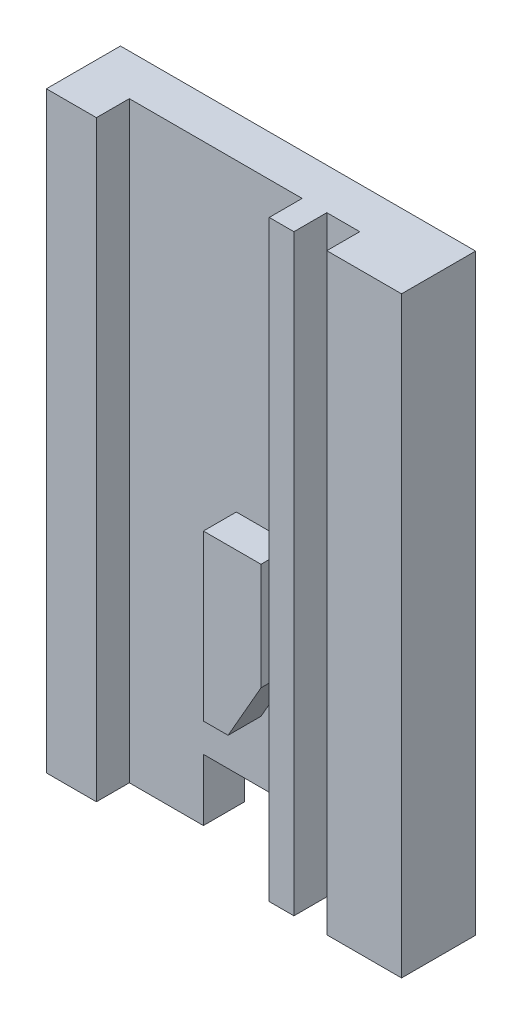
ISO-10303-21;
HEADER;
FILE_DESCRIPTION(('STEP AP214'),'2;1');
FILE_NAME('part.step','',(''),(''),'','','');
FILE_SCHEMA(('AUTOMOTIVE_DESIGN { 1 0 10303 214 1 1 1 1 }'));
ENDSEC;
DATA;
#1=APPLICATION_CONTEXT('core data for automotive mechanical design processes');
#2=APPLICATION_PROTOCOL_DEFINITION('international standard','automotive_design',2000,#1);
#3=PRODUCT_CONTEXT('',#1,'mechanical');
#4=PRODUCT('Part','Part','',(#3));
#5=PRODUCT_RELATED_PRODUCT_CATEGORY('part','',(#4));
#6=PRODUCT_DEFINITION_FORMATION('','',#4);
#7=PRODUCT_DEFINITION_CONTEXT('part definition',#1,'design');
#8=PRODUCT_DEFINITION('design','',#6,#7);
#9=PRODUCT_DEFINITION_SHAPE('','',#8);
#10=(LENGTH_UNIT() NAMED_UNIT(*) SI_UNIT(.MILLI.,.METRE.));
#11=(NAMED_UNIT(*) PLANE_ANGLE_UNIT() SI_UNIT($,.RADIAN.));
#12=(NAMED_UNIT(*) SI_UNIT($,.STERADIAN.) SOLID_ANGLE_UNIT());
#13=UNCERTAINTY_MEASURE_WITH_UNIT(LENGTH_MEASURE(1.E-05),#10,'distance_accuracy_value','');
#14=(GEOMETRIC_REPRESENTATION_CONTEXT(3) GLOBAL_UNCERTAINTY_ASSIGNED_CONTEXT((#13)) GLOBAL_UNIT_ASSIGNED_CONTEXT((#10,
#11,#12)) REPRESENTATION_CONTEXT('',''));
#15=CARTESIAN_POINT('',(0.,0.,0.));
#16=DIRECTION('',(0.,0.,1.));
#17=DIRECTION('',(1.,0.,0.));
#18=AXIS2_PLACEMENT_3D('',#15,#16,#17);
#19=CARTESIAN_POINT('',(6.07043781289502,-8.66148865029143,4.05444085203499));
#20=DIRECTION('',(0.,0.,-1.));
#21=DIRECTION('',(-1.,0.,0.));
#22=AXIS2_PLACEMENT_3D('',#19,#20,#21);
#23=PLANE('',#22);
#24=DIRECTION('',(0.,-1.,0.));
#25=VECTOR('',#24,1.);
#26=CARTESIAN_POINT('',(2.05043781289502,-6.78648865029143,4.05444085203499));
#27=LINE('',#26,#25);
#28=CARTESIAN_POINT('',(2.05043781289502,9.33851134970858,4.05444085203499));
#29=VERTEX_POINT('',#28);
#30=CARTESIAN_POINT('',(2.05043781289502,-6.78648865029142,4.05444085203499));
#31=VERTEX_POINT('',#30);
#32=EDGE_CURVE('E266',#29,#31,#27,.T.);
#33=ORIENTED_EDGE('',*,*,#32,.F.);
#34=DIRECTION('',(-1.,0.,0.));
#35=VECTOR('',#34,1.);
#36=CARTESIAN_POINT('',(6.07043781289502,9.33851134970858,4.05444085203499));
#37=LINE('',#36,#35);
#38=CARTESIAN_POINT('',(-3.19956218710498,9.33851134970858,4.05444085203499));
#39=VERTEX_POINT('',#38);
#40=EDGE_CURVE('E304',#29,#39,#37,.T.);
#41=ORIENTED_EDGE('',*,*,#40,.T.);
#42=DIRECTION('',(0.,1.,0.));
#43=VECTOR('',#42,1.);
#44=CARTESIAN_POINT('',(-3.19956218710498,-8.66148865029143,4.05444085203499));
#45=LINE('',#44,#43);
#46=CARTESIAN_POINT('',(-3.19956218710498,-8.66148865029143,4.05444085203499));
#47=VERTEX_POINT('',#46);
#48=EDGE_CURVE('E316',#47,#39,#45,.T.);
#49=ORIENTED_EDGE('',*,*,#48,.F.);
#50=DIRECTION('',(-1.,0.,0.));
#51=VECTOR('',#50,1.);
#52=CARTESIAN_POINT('',(6.07043781289502,-8.66148865029143,4.05444085203499));
#53=LINE('',#52,#51);
#54=CARTESIAN_POINT('',(-0.949562187104979,-8.66148865029142,4.05444085203499));
#55=VERTEX_POINT('',#54);
#56=EDGE_CURVE('E308',#55,#47,#53,.T.);
#57=ORIENTED_EDGE('',*,*,#56,.F.);
#58=DIRECTION('',(0.,-1.,0.));
#59=VECTOR('',#58,1.);
#60=CARTESIAN_POINT('',(-0.949562187104979,-6.78648865029142,4.05444085203499));
#61=LINE('',#60,#59);
#62=CARTESIAN_POINT('',(-0.949562187104979,-6.78648865029142,4.05444085203499));
#63=VERTEX_POINT('',#62);
#64=EDGE_CURVE('E291',#63,#55,#61,.T.);
#65=ORIENTED_EDGE('',*,*,#64,.F.);
#66=DIRECTION('',(-1.,0.,0.));
#67=VECTOR('',#66,1.);
#68=CARTESIAN_POINT('',(6.07043781289502,-6.78648865029142,4.05444085203499));
#69=LINE('',#68,#67);
#70=EDGE_CURVE('E286',#31,#63,#69,.T.);
#71=ORIENTED_EDGE('',*,*,#70,.F.);
#72=EDGE_LOOP('',(#33,#41,#49,#57,#65,#71));
#73=FACE_BOUND('',#72,.T.);
#74=DIRECTION('',(0.,-1.,0.));
#75=VECTOR('',#74,1.);
#76=CARTESIAN_POINT('',(0.0504378128950199,-4.91148865029142,4.05444085203499));
#77=LINE('',#76,#75);
#78=CARTESIAN_POINT('',(0.0504378128950196,0.0885113497085755,4.05444085203499));
#79=VERTEX_POINT('',#78);
#80=CARTESIAN_POINT('',(0.0504378128950206,-4.91148865029142,4.05444085203499));
#81=VERTEX_POINT('',#80);
#82=EDGE_CURVE('E199',#79,#81,#77,.T.);
#83=ORIENTED_EDGE('',*,*,#82,.F.);
#84=DIRECTION('',(-1.,0.,0.));
#85=VECTOR('',#84,1.);
#86=CARTESIAN_POINT('',(0.0504378128950196,0.0885113497085755,4.05444085203499));
#87=LINE('',#86,#85);
#88=CARTESIAN_POINT('',(1.80043781289502,0.0885113497085744,4.05444085203499));
#89=VERTEX_POINT('',#88);
#90=EDGE_CURVE('E196',#89,#79,#87,.T.);
#91=ORIENTED_EDGE('',*,*,#90,.F.);
#92=DIRECTION('',(0.,1.,0.));
#93=VECTOR('',#92,1.);
#94=CARTESIAN_POINT('',(1.80043781289502,0.0885113497085756,4.05444085203499));
#95=LINE('',#94,#93);
#96=CARTESIAN_POINT('',(1.80043781289502,-3.16148865029142,4.05444085203499));
#97=VERTEX_POINT('',#96);
#98=EDGE_CURVE('E585',#97,#89,#95,.T.);
#99=ORIENTED_EDGE('',*,*,#98,.F.);
#100=DIRECTION('',(0.496138938356833,0.86824314212446,0.));
#101=VECTOR('',#100,1.);
#102=CARTESIAN_POINT('',(1.80043781289502,-3.16148865029142,4.05444085203499));
#103=LINE('',#102,#101);
#104=CARTESIAN_POINT('',(0.80043781289502,-4.91148865029142,4.05444085203499));
#105=VERTEX_POINT('',#104);
#106=EDGE_CURVE('E61',#105,#97,#103,.T.);
#107=ORIENTED_EDGE('',*,*,#106,.F.);
#108=DIRECTION('',(1.,0.,0.));
#109=VECTOR('',#108,1.);
#110=CARTESIAN_POINT('',(0.800437812895021,-4.91148865029142,4.05444085203499));
#111=LINE('',#110,#109);
#112=EDGE_CURVE('E56',#81,#105,#111,.T.);
#113=ORIENTED_EDGE('',*,*,#112,.F.);
#114=EDGE_LOOP('',(#83,#91,#99,#107,#113));
#115=FACE_BOUND('',#114,.T.);
#116=ADVANCED_FACE('F38',(#73,#115),#23,.F.);
#117=CARTESIAN_POINT('',(0.675437812895019,0.338511349708575,5.054440852035));
#118=DIRECTION('',(0.,0.,-1.));
#119=DIRECTION('',(-1.,0.,0.));
#120=AXIS2_PLACEMENT_3D('',#117,#118,#119);
#121=PLANE('',#120);
#122=DIRECTION('',(-1.,0.,0.));
#123=VECTOR('',#122,1.);
#124=CARTESIAN_POINT('',(2.05043781289502,-8.66148865029142,5.054440852035));
#125=LINE('',#124,#123);
#126=CARTESIAN_POINT('',(2.80043781289502,-8.66148865029143,5.054440852035));
#127=VERTEX_POINT('',#126);
#128=CARTESIAN_POINT('',(2.05043781289502,-8.66148865029142,5.054440852035));
#129=VERTEX_POINT('',#128);
#130=EDGE_CURVE('E249',#127,#129,#125,.T.);
#131=ORIENTED_EDGE('',*,*,#130,.F.);
#132=DIRECTION('',(0.,1.,0.));
#133=VECTOR('',#132,1.);
#134=CARTESIAN_POINT('',(2.80043781289502,-8.66148865029143,5.054440852035));
#135=LINE('',#134,#133);
#136=CARTESIAN_POINT('',(2.80043781289502,9.33851134970858,5.054440852035));
#137=VERTEX_POINT('',#136);
#138=EDGE_CURVE('E223',#127,#137,#135,.T.);
#139=ORIENTED_EDGE('',*,*,#138,.T.);
#140=DIRECTION('',(-1.,0.,0.));
#141=VECTOR('',#140,1.);
#142=CARTESIAN_POINT('',(2.05043781289502,9.33851134970858,5.054440852035));
#143=LINE('',#142,#141);
#144=CARTESIAN_POINT('',(2.05043781289502,9.33851134970858,5.054440852035));
#145=VERTEX_POINT('',#144);
#146=EDGE_CURVE('E271',#137,#145,#143,.T.);
#147=ORIENTED_EDGE('',*,*,#146,.T.);
#148=DIRECTION('',(0.,-1.,0.));
#149=VECTOR('',#148,1.);
#150=CARTESIAN_POINT('',(2.05043781289502,-6.78648865029143,5.054440852035));
#151=LINE('',#150,#149);
#152=EDGE_CURVE('E276',#145,#129,#151,.T.);
#153=ORIENTED_EDGE('',*,*,#152,.T.);
#154=EDGE_LOOP('',(#131,#139,#147,#153));
#155=FACE_BOUND('',#154,.T.);
#156=ADVANCED_FACE('F398',(#155),#121,.F.);
#157=CARTESIAN_POINT('',(6.07043781289502,-6.78648865029142,2.80444085203499));
#158=DIRECTION('',(0.,1.,0.));
#159=DIRECTION('',(-1.,0.,0.));
#160=AXIS2_PLACEMENT_3D('',#157,#158,#159);
#161=PLANE('',#160);
#162=DIRECTION('',(0.,0.,-1.));
#163=VECTOR('',#162,1.);
#164=CARTESIAN_POINT('',(2.05043781289502,-6.78648865029142,2.80444085203499));
#165=LINE('',#164,#163);
#166=CARTESIAN_POINT('',(2.05043781289502,-6.78648865029142,2.80444085203499));
#167=VERTEX_POINT('',#166);
#168=EDGE_CURVE('E234',#31,#167,#165,.T.);
#169=ORIENTED_EDGE('',*,*,#168,.F.);
#170=ORIENTED_EDGE('',*,*,#70,.T.);
#171=DIRECTION('',(0.,0.,1.));
#172=VECTOR('',#171,1.);
#173=CARTESIAN_POINT('',(-0.949562187104979,-6.78648865029142,2.80444085203499));
#174=LINE('',#173,#172);
#175=CARTESIAN_POINT('',(-0.949562187104979,-6.78648865029142,2.80444085203499));
#176=VERTEX_POINT('',#175);
#177=EDGE_CURVE('E295',#176,#63,#174,.T.);
#178=ORIENTED_EDGE('',*,*,#177,.F.);
#179=DIRECTION('',(-1.,0.,0.));
#180=VECTOR('',#179,1.);
#181=CARTESIAN_POINT('',(6.07043781289502,-6.78648865029142,2.80444085203499));
#182=LINE('',#181,#180);
#183=EDGE_CURVE('E287',#167,#176,#182,.T.);
#184=ORIENTED_EDGE('',*,*,#183,.F.);
#185=EDGE_LOOP('',(#169,#170,#178,#184));
#186=FACE_BOUND('',#185,.T.);
#187=ADVANCED_FACE('F419',(#186),#161,.F.);
#188=CARTESIAN_POINT('',(-4.71956218710498,9.33851134970858,5.054440852035));
#189=DIRECTION('',(0.,1.,0.));
#190=DIRECTION('',(0.,0.,1.));
#191=AXIS2_PLACEMENT_3D('',#188,#189,#190);
#192=PLANE('',#191);
#193=DIRECTION('',(0.,0.,1.));
#194=VECTOR('',#193,1.);
#195=CARTESIAN_POINT('',(2.80043781289502,9.33851134970858,4.05444085203499));
#196=LINE('',#195,#194);
#197=CARTESIAN_POINT('',(2.80043781289502,9.33851134970858,4.05444085203499));
#198=VERTEX_POINT('',#197);
#199=EDGE_CURVE('E201',#198,#137,#196,.T.);
#200=ORIENTED_EDGE('',*,*,#199,.F.);
#201=DIRECTION('',(-1.,0.,0.));
#202=VECTOR('',#201,1.);
#203=CARTESIAN_POINT('',(3.80043781289502,9.33851134970858,4.05444085203499));
#204=LINE('',#203,#202);
#205=CARTESIAN_POINT('',(3.80043781289502,9.33851134970858,4.05444085203499));
#206=VERTEX_POINT('',#205);
#207=EDGE_CURVE('E216',#206,#198,#204,.T.);
#208=ORIENTED_EDGE('',*,*,#207,.F.);
#209=DIRECTION('',(0.,0.,-1.));
#210=VECTOR('',#209,1.);
#211=CARTESIAN_POINT('',(3.80043781289502,9.33851134970858,5.054440852035));
#212=LINE('',#211,#210);
#213=CARTESIAN_POINT('',(3.80043781289502,9.33851134970858,5.054440852035));
#214=VERTEX_POINT('',#213);
#215=EDGE_CURVE('E205',#214,#206,#212,.T.);
#216=ORIENTED_EDGE('',*,*,#215,.F.);
#217=CARTESIAN_POINT('',(6.07043781289502,9.33851134970858,5.054440852035));
#218=VERTEX_POINT('',#217);
#219=EDGE_CURVE('E272',#218,#214,#143,.T.);
#220=ORIENTED_EDGE('',*,*,#219,.F.);
#221=DIRECTION('',(0.,0.,-1.));
#222=VECTOR('',#221,1.);
#223=CARTESIAN_POINT('',(6.07043781289502,9.33851134970858,5.054440852035));
#224=LINE('',#223,#222);
#225=CARTESIAN_POINT('',(6.07043781289502,9.33851134970858,2.80444085203499));
#226=VERTEX_POINT('',#225);
#227=EDGE_CURVE('E42',#218,#226,#224,.T.);
#228=ORIENTED_EDGE('',*,*,#227,.T.);
#229=DIRECTION('',(1.,0.,0.));
#230=VECTOR('',#229,1.);
#231=CARTESIAN_POINT('',(-4.71956218710498,9.33851134970858,2.80444085203499));
#232=LINE('',#231,#230);
#233=CARTESIAN_POINT('',(-4.71956218710498,9.33851134970858,2.80444085203499));
#234=VERTEX_POINT('',#233);
#235=EDGE_CURVE('E325',#234,#226,#232,.T.);
#236=ORIENTED_EDGE('',*,*,#235,.F.);
#237=DIRECTION('',(0.,0.,-1.));
#238=VECTOR('',#237,1.);
#239=CARTESIAN_POINT('',(-4.71956218710498,9.33851134970858,5.054440852035));
#240=LINE('',#239,#238);
#241=CARTESIAN_POINT('',(-4.71956218710498,9.33851134970858,5.054440852035));
#242=VERTEX_POINT('',#241);
#243=EDGE_CURVE('E11',#242,#234,#240,.T.);
#244=ORIENTED_EDGE('',*,*,#243,.F.);
#245=DIRECTION('',(1.,0.,0.));
#246=VECTOR('',#245,1.);
#247=CARTESIAN_POINT('',(-4.71956218710498,9.33851134970858,5.054440852035));
#248=LINE('',#247,#246);
#249=CARTESIAN_POINT('',(-3.19956218710498,9.33851134970858,5.054440852035));
#250=VERTEX_POINT('',#249);
#251=EDGE_CURVE('E329',#242,#250,#248,.T.);
#252=ORIENTED_EDGE('',*,*,#251,.T.);
#253=DIRECTION('',(0.,0.,1.));
#254=VECTOR('',#253,1.);
#255=CARTESIAN_POINT('',(-3.19956218710498,9.33851134970858,4.05444085203499));
#256=LINE('',#255,#254);
#257=EDGE_CURVE('E312',#39,#250,#256,.T.);
#258=ORIENTED_EDGE('',*,*,#257,.F.);
#259=ORIENTED_EDGE('',*,*,#40,.F.);
#260=DIRECTION('',(0.,0.,-1.));
#261=VECTOR('',#260,1.);
#262=CARTESIAN_POINT('',(2.05043781289502,9.33851134970858,5.054440852035));
#263=LINE('',#262,#261);
#264=EDGE_CURVE('E280',#145,#29,#263,.T.);
#265=ORIENTED_EDGE('',*,*,#264,.F.);
#266=ORIENTED_EDGE('',*,*,#146,.F.);
#267=EDGE_LOOP('',(#200,#208,#216,#220,#228,#236,#244,#252,#258,#259,#265,#266));
#268=FACE_BOUND('',#267,.T.);
#269=ADVANCED_FACE('F40',(#268),#192,.T.);
#270=CARTESIAN_POINT('',(-4.71956218710498,-8.66148865029143,5.054440852035));
#271=DIRECTION('',(-1.,0.,0.));
#272=DIRECTION('',(0.,-1.,0.));
#273=AXIS2_PLACEMENT_3D('',#270,#271,#272);
#274=PLANE('',#273);
#275=DIRECTION('',(0.,1.,0.));
#276=VECTOR('',#275,1.);
#277=CARTESIAN_POINT('',(-4.71956218710498,-8.66148865029143,2.80444085203499));
#278=LINE('',#277,#276);
#279=CARTESIAN_POINT('',(-4.71956218710498,-8.66148865029143,2.80444085203499));
#280=VERTEX_POINT('',#279);
#281=EDGE_CURVE('E334',#280,#234,#278,.T.);
#282=ORIENTED_EDGE('',*,*,#281,.F.);
#283=DIRECTION('',(0.,0.,-1.));
#284=VECTOR('',#283,1.);
#285=CARTESIAN_POINT('',(-4.71956218710498,-8.66148865029143,5.054440852035));
#286=LINE('',#285,#284);
#287=CARTESIAN_POINT('',(-4.71956218710498,-8.66148865029143,5.054440852035));
#288=VERTEX_POINT('',#287);
#289=EDGE_CURVE('E48',#288,#280,#286,.T.);
#290=ORIENTED_EDGE('',*,*,#289,.F.);
#291=DIRECTION('',(0.,1.,0.));
#292=VECTOR('',#291,1.);
#293=CARTESIAN_POINT('',(-4.71956218710498,-8.66148865029143,5.054440852035));
#294=LINE('',#293,#292);
#295=EDGE_CURVE('E337',#288,#242,#294,.T.);
#296=ORIENTED_EDGE('',*,*,#295,.T.);
#297=ORIENTED_EDGE('',*,*,#243,.T.);
#298=EDGE_LOOP('',(#282,#290,#296,#297));
#299=FACE_BOUND('',#298,.T.);
#300=ADVANCED_FACE('F372',(#299),#274,.T.);
#301=CARTESIAN_POINT('',(6.07043781289502,-8.66148865029142,5.054440852035));
#302=DIRECTION('',(0.,-1.,0.));
#303=DIRECTION('',(1.,0.,0.));
#304=AXIS2_PLACEMENT_3D('',#301,#302,#303);
#305=PLANE('',#304);
#306=DIRECTION('',(0.,0.,1.));
#307=VECTOR('',#306,1.);
#308=CARTESIAN_POINT('',(-0.949562187104979,-8.66148865029142,2.80444085203499));
#309=LINE('',#308,#307);
#310=CARTESIAN_POINT('',(-0.949562187104979,-8.66148865029142,2.80444085203499));
#311=VERTEX_POINT('',#310);
#312=EDGE_CURVE('E300',#311,#55,#309,.T.);
#313=ORIENTED_EDGE('',*,*,#312,.T.);
#314=ORIENTED_EDGE('',*,*,#56,.T.);
#315=DIRECTION('',(0.,0.,1.));
#316=VECTOR('',#315,1.);
#317=CARTESIAN_POINT('',(-3.19956218710498,-8.66148865029143,4.05444085203499));
#318=LINE('',#317,#316);
#319=CARTESIAN_POINT('',(-3.19956218710498,-8.66148865029143,5.054440852035));
#320=VERTEX_POINT('',#319);
#321=EDGE_CURVE('E311',#47,#320,#318,.T.);
#322=ORIENTED_EDGE('',*,*,#321,.T.);
#323=DIRECTION('',(-1.,0.,0.));
#324=VECTOR('',#323,1.);
#325=CARTESIAN_POINT('',(6.07043781289502,-8.66148865029142,5.054440852035));
#326=LINE('',#325,#324);
#327=EDGE_CURVE('E333',#320,#288,#326,.T.);
#328=ORIENTED_EDGE('',*,*,#327,.T.);
#329=ORIENTED_EDGE('',*,*,#289,.T.);
#330=DIRECTION('',(-1.,0.,0.));
#331=VECTOR('',#330,1.);
#332=CARTESIAN_POINT('',(6.07043781289502,-8.66148865029142,2.80444085203499));
#333=LINE('',#332,#331);
#334=EDGE_CURVE('E347',#311,#280,#333,.T.);
#335=ORIENTED_EDGE('',*,*,#334,.F.);
#336=EDGE_LOOP('',(#313,#314,#322,#328,#329,#335));
#337=FACE_BOUND('',#336,.T.);
#338=ADVANCED_FACE('F382',(#337),#305,.T.);
#339=CARTESIAN_POINT('',(6.07043781289502,9.33851134970858,5.054440852035));
#340=DIRECTION('',(1.,0.,0.));
#341=DIRECTION('',(0.,0.,-1.));
#342=AXIS2_PLACEMENT_3D('',#339,#340,#341);
#343=PLANE('',#342);
#344=DIRECTION('',(0.,1.,0.));
#345=VECTOR('',#344,1.);
#346=CARTESIAN_POINT('',(6.07043781289502,9.33851134970858,5.054440852035));
#347=LINE('',#346,#345);
#348=CARTESIAN_POINT('',(6.07043781289502,-8.66148865029142,5.054440852035));
#349=VERTEX_POINT('',#348);
#350=EDGE_CURVE('E267',#349,#218,#347,.T.);
#351=ORIENTED_EDGE('',*,*,#350,.F.);
#352=DIRECTION('',(0.,0.,1.));
#353=VECTOR('',#352,1.);
#354=CARTESIAN_POINT('',(6.07043781289502,-8.66148865029142,5.054440852035));
#355=LINE('',#354,#353);
#356=CARTESIAN_POINT('',(6.07043781289502,-8.66148865029142,2.80444085203499));
#357=VERTEX_POINT('',#356);
#358=EDGE_CURVE('E256',#357,#349,#355,.T.);
#359=ORIENTED_EDGE('',*,*,#358,.F.);
#360=DIRECTION('',(0.,-1.,0.));
#361=VECTOR('',#360,1.);
#362=CARTESIAN_POINT('',(6.07043781289502,9.33851134970858,2.80444085203499));
#363=LINE('',#362,#361);
#364=EDGE_CURVE('E344',#226,#357,#363,.T.);
#365=ORIENTED_EDGE('',*,*,#364,.F.);
#366=ORIENTED_EDGE('',*,*,#227,.F.);
#367=EDGE_LOOP('',(#351,#359,#365,#366));
#368=FACE_BOUND('',#367,.T.);
#369=ADVANCED_FACE('F367',(#368),#343,.T.);
#370=CARTESIAN_POINT('',(0.675437812895019,0.338511349708575,5.054440852035));
#371=DIRECTION('',(0.,0.,-1.));
#372=DIRECTION('',(-1.,0.,0.));
#373=AXIS2_PLACEMENT_3D('',#370,#371,#372);
#374=PLANE('',#373);
#375=ORIENTED_EDGE('',*,*,#327,.F.);
#376=DIRECTION('',(0.,1.,0.));
#377=VECTOR('',#376,1.);
#378=CARTESIAN_POINT('',(-3.19956218710498,-8.66148865029143,5.054440852035));
#379=LINE('',#378,#377);
#380=EDGE_CURVE('E321',#320,#250,#379,.T.);
#381=ORIENTED_EDGE('',*,*,#380,.T.);
#382=ORIENTED_EDGE('',*,*,#251,.F.);
#383=ORIENTED_EDGE('',*,*,#295,.F.);
#384=EDGE_LOOP('',(#375,#381,#382,#383));
#385=FACE_BOUND('',#384,.T.);
#386=ADVANCED_FACE('F378',(#385),#374,.F.);
#387=CARTESIAN_POINT('',(0.675437812895019,0.338511349708575,2.80444085203499));
#388=DIRECTION('',(0.,0.,-1.));
#389=DIRECTION('',(-1.,0.,0.));
#390=AXIS2_PLACEMENT_3D('',#387,#388,#389);
#391=PLANE('',#390);
#392=DIRECTION('',(0.,-1.,0.));
#393=VECTOR('',#392,1.);
#394=CARTESIAN_POINT('',(-0.949562187104979,-6.78648865029142,2.80444085203499));
#395=LINE('',#394,#393);
#396=EDGE_CURVE('E290',#176,#311,#395,.T.);
#397=ORIENTED_EDGE('',*,*,#396,.T.);
#398=ORIENTED_EDGE('',*,*,#334,.T.);
#399=ORIENTED_EDGE('',*,*,#281,.T.);
#400=ORIENTED_EDGE('',*,*,#235,.T.);
#401=ORIENTED_EDGE('',*,*,#364,.T.);
#402=DIRECTION('',(1.,0.,0.));
#403=VECTOR('',#402,1.);
#404=CARTESIAN_POINT('',(6.07043781289502,-8.66148865029142,2.80444085203499));
#405=LINE('',#404,#403);
#406=CARTESIAN_POINT('',(2.05043781289502,-8.66148865029142,2.80444085203499));
#407=VERTEX_POINT('',#406);
#408=EDGE_CURVE('E252',#407,#357,#405,.T.);
#409=ORIENTED_EDGE('',*,*,#408,.F.);
#410=DIRECTION('',(0.,1.,0.));
#411=VECTOR('',#410,1.);
#412=CARTESIAN_POINT('',(2.05043781289502,-8.66148865029142,2.80444085203499));
#413=LINE('',#412,#411);
#414=EDGE_CURVE('E260',#407,#167,#413,.T.);
#415=ORIENTED_EDGE('',*,*,#414,.T.);
#416=ORIENTED_EDGE('',*,*,#183,.T.);
#417=EDGE_LOOP('',(#397,#398,#399,#400,#401,#409,#415,#416));
#418=FACE_BOUND('',#417,.T.);
#419=ADVANCED_FACE('F370',(#418),#391,.T.);
#420=CARTESIAN_POINT('',(-3.19956218710498,-8.66148865029143,4.05444085203499));
#421=DIRECTION('',(-1.,0.,0.));
#422=DIRECTION('',(0.,0.,1.));
#423=AXIS2_PLACEMENT_3D('',#420,#421,#422);
#424=PLANE('',#423);
#425=ORIENTED_EDGE('',*,*,#257,.T.);
#426=ORIENTED_EDGE('',*,*,#380,.F.);
#427=ORIENTED_EDGE('',*,*,#321,.F.);
#428=ORIENTED_EDGE('',*,*,#48,.T.);
#429=EDGE_LOOP('',(#425,#426,#427,#428));
#430=FACE_BOUND('',#429,.T.);
#431=ADVANCED_FACE('F381',(#430),#424,.F.);
#432=CARTESIAN_POINT('',(-0.949562187104979,-6.78648865029142,2.80444085203499));
#433=DIRECTION('',(-1.,0.,0.));
#434=DIRECTION('',(0.,0.,1.));
#435=AXIS2_PLACEMENT_3D('',#432,#433,#434);
#436=PLANE('',#435);
#437=ORIENTED_EDGE('',*,*,#64,.T.);
#438=ORIENTED_EDGE('',*,*,#312,.F.);
#439=ORIENTED_EDGE('',*,*,#396,.F.);
#440=ORIENTED_EDGE('',*,*,#177,.T.);
#441=EDGE_LOOP('',(#437,#438,#439,#440));
#442=FACE_BOUND('',#441,.T.);
#443=ADVANCED_FACE('F423',(#442),#436,.F.);
#444=CARTESIAN_POINT('',(2.05043781289502,-6.78648865029143,5.054440852035));
#445=DIRECTION('',(1.,0.,0.));
#446=DIRECTION('',(0.,1.,0.));
#447=AXIS2_PLACEMENT_3D('',#444,#445,#446);
#448=PLANE('',#447);
#449=ORIENTED_EDGE('',*,*,#32,.T.);
#450=ORIENTED_EDGE('',*,*,#168,.T.);
#451=ORIENTED_EDGE('',*,*,#414,.F.);
#452=DIRECTION('',(0.,0.,-1.));
#453=VECTOR('',#452,1.);
#454=CARTESIAN_POINT('',(2.05043781289502,-8.66148865029142,2.80444085203499));
#455=LINE('',#454,#453);
#456=EDGE_CURVE('E248',#129,#407,#455,.T.);
#457=ORIENTED_EDGE('',*,*,#456,.F.);
#458=ORIENTED_EDGE('',*,*,#152,.F.);
#459=ORIENTED_EDGE('',*,*,#264,.T.);
#460=EDGE_LOOP('',(#449,#450,#451,#457,#458,#459));
#461=FACE_BOUND('',#460,.T.);
#462=ADVANCED_FACE('F394',(#461),#448,.F.);
#463=ORIENTED_EDGE('',*,*,#219,.T.);
#464=DIRECTION('',(0.,1.,0.));
#465=VECTOR('',#464,1.);
#466=CARTESIAN_POINT('',(3.80043781289502,-8.66148865029143,5.054440852035));
#467=LINE('',#466,#465);
#468=CARTESIAN_POINT('',(3.80043781289502,-8.66148865029143,5.054440852035));
#469=VERTEX_POINT('',#468);
#470=EDGE_CURVE('E238',#469,#214,#467,.T.);
#471=ORIENTED_EDGE('',*,*,#470,.F.);
#472=EDGE_CURVE('E244',#349,#469,#125,.T.);
#473=ORIENTED_EDGE('',*,*,#472,.F.);
#474=ORIENTED_EDGE('',*,*,#350,.T.);
#475=EDGE_LOOP('',(#463,#471,#473,#474));
#476=FACE_BOUND('',#475,.T.);
#477=ADVANCED_FACE('F415',(#476),#121,.F.);
#478=CARTESIAN_POINT('',(0.675437812895023,-8.66148865029143,2.80444085203499));
#479=DIRECTION('',(0.,1.,0.));
#480=DIRECTION('',(-1.,0.,0.));
#481=AXIS2_PLACEMENT_3D('',#478,#479,#480);
#482=PLANE('',#481);
#483=DIRECTION('',(-1.,0.,0.));
#484=VECTOR('',#483,1.);
#485=CARTESIAN_POINT('',(3.80043781289502,-8.66148865029143,4.05444085203499));
#486=LINE('',#485,#484);
#487=CARTESIAN_POINT('',(3.80043781289502,-8.66148865029142,4.05444085203499));
#488=VERTEX_POINT('',#487);
#489=CARTESIAN_POINT('',(2.80043781289502,-8.66148865029143,4.05444085203499));
#490=VERTEX_POINT('',#489);
#491=EDGE_CURVE('E220',#488,#490,#486,.T.);
#492=ORIENTED_EDGE('',*,*,#491,.T.);
#493=DIRECTION('',(0.,0.,1.));
#494=VECTOR('',#493,1.);
#495=CARTESIAN_POINT('',(2.80043781289502,-8.66148865029143,4.05444085203499));
#496=LINE('',#495,#494);
#497=EDGE_CURVE('E211',#490,#127,#496,.T.);
#498=ORIENTED_EDGE('',*,*,#497,.T.);
#499=ORIENTED_EDGE('',*,*,#130,.T.);
#500=ORIENTED_EDGE('',*,*,#456,.T.);
#501=ORIENTED_EDGE('',*,*,#408,.T.);
#502=ORIENTED_EDGE('',*,*,#358,.T.);
#503=ORIENTED_EDGE('',*,*,#472,.T.);
#504=DIRECTION('',(0.,0.,-1.));
#505=VECTOR('',#504,1.);
#506=CARTESIAN_POINT('',(3.80043781289502,-8.66148865029143,5.054440852035));
#507=LINE('',#506,#505);
#508=EDGE_CURVE('E215',#469,#488,#507,.T.);
#509=ORIENTED_EDGE('',*,*,#508,.T.);
#510=EDGE_LOOP('',(#492,#498,#499,#500,#501,#502,#503,#509));
#511=FACE_BOUND('',#510,.T.);
#512=ADVANCED_FACE('F402',(#511),#482,.F.);
#513=CARTESIAN_POINT('',(2.80043781289502,-8.66148865029143,4.05444085203499));
#514=DIRECTION('',(-1.,0.,0.));
#515=DIRECTION('',(0.,0.,1.));
#516=AXIS2_PLACEMENT_3D('',#513,#514,#515);
#517=PLANE('',#516);
#518=ORIENTED_EDGE('',*,*,#199,.T.);
#519=ORIENTED_EDGE('',*,*,#138,.F.);
#520=ORIENTED_EDGE('',*,*,#497,.F.);
#521=DIRECTION('',(0.,1.,0.));
#522=VECTOR('',#521,1.);
#523=CARTESIAN_POINT('',(2.80043781289502,-8.66148865029143,4.05444085203499));
#524=LINE('',#523,#522);
#525=EDGE_CURVE('E231',#490,#198,#524,.T.);
#526=ORIENTED_EDGE('',*,*,#525,.T.);
#527=EDGE_LOOP('',(#518,#519,#520,#526));
#528=FACE_BOUND('',#527,.T.);
#529=ADVANCED_FACE('F405',(#528),#517,.F.);
#530=CARTESIAN_POINT('',(3.80043781289502,-8.66148865029143,4.05444085203499));
#531=DIRECTION('',(0.,0.,-1.));
#532=DIRECTION('',(-1.,0.,0.));
#533=AXIS2_PLACEMENT_3D('',#530,#531,#532);
#534=PLANE('',#533);
#535=ORIENTED_EDGE('',*,*,#207,.T.);
#536=ORIENTED_EDGE('',*,*,#525,.F.);
#537=ORIENTED_EDGE('',*,*,#491,.F.);
#538=DIRECTION('',(0.,1.,0.));
#539=VECTOR('',#538,1.);
#540=CARTESIAN_POINT('',(3.80043781289502,-8.66148865029143,4.05444085203499));
#541=LINE('',#540,#539);
#542=EDGE_CURVE('E235',#488,#206,#541,.T.);
#543=ORIENTED_EDGE('',*,*,#542,.T.);
#544=EDGE_LOOP('',(#535,#536,#537,#543));
#545=FACE_BOUND('',#544,.T.);
#546=ADVANCED_FACE('F408',(#545),#534,.F.);
#547=CARTESIAN_POINT('',(3.80043781289502,-8.66148865029143,5.054440852035));
#548=DIRECTION('',(1.,0.,0.));
#549=DIRECTION('',(0.,0.,-1.));
#550=AXIS2_PLACEMENT_3D('',#547,#548,#549);
#551=PLANE('',#550);
#552=ORIENTED_EDGE('',*,*,#215,.T.);
#553=ORIENTED_EDGE('',*,*,#542,.F.);
#554=ORIENTED_EDGE('',*,*,#508,.F.);
#555=ORIENTED_EDGE('',*,*,#470,.T.);
#556=EDGE_LOOP('',(#552,#553,#554,#555));
#557=FACE_BOUND('',#556,.T.);
#558=ADVANCED_FACE('F411',(#557),#551,.F.);
#559=CARTESIAN_POINT('',(0.0504378128950199,-4.91148865029142,5.054440852035));
#560=DIRECTION('',(1.,0.,0.));
#561=DIRECTION('',(0.,1.,0.));
#562=AXIS2_PLACEMENT_3D('',#559,#560,#561);
#563=PLANE('',#562);
#564=ORIENTED_EDGE('',*,*,#82,.T.);
#565=DIRECTION('',(0.,0.,-1.));
#566=VECTOR('',#565,1.);
#567=CARTESIAN_POINT('',(0.0504378128950199,-4.91148865029142,5.054440852035));
#568=LINE('',#567,#566);
#569=CARTESIAN_POINT('',(0.0504378128950199,-4.91148865029142,5.054440852035));
#570=VERTEX_POINT('',#569);
#571=EDGE_CURVE('E178',#570,#81,#568,.T.);
#572=ORIENTED_EDGE('',*,*,#571,.F.);
#573=DIRECTION('',(0.,-1.,0.));
#574=VECTOR('',#573,1.);
#575=CARTESIAN_POINT('',(0.0504378128950199,-4.91148865029142,5.054440852035));
#576=LINE('',#575,#574);
#577=CARTESIAN_POINT('',(0.0504378128950196,0.0885113497085755,5.054440852035));
#578=VERTEX_POINT('',#577);
#579=EDGE_CURVE('E186',#578,#570,#576,.T.);
#580=ORIENTED_EDGE('',*,*,#579,.F.);
#581=DIRECTION('',(0.,0.,-1.));
#582=VECTOR('',#581,1.);
#583=CARTESIAN_POINT('',(0.0504378128950196,0.0885113497085755,5.054440852035));
#584=LINE('',#583,#582);
#585=EDGE_CURVE('E580',#578,#79,#584,.T.);
#586=ORIENTED_EDGE('',*,*,#585,.T.);
#587=EDGE_LOOP('',(#564,#572,#580,#586));
#588=FACE_BOUND('',#587,.T.);
#589=ADVANCED_FACE('F198',(#588),#563,.F.);
#590=CARTESIAN_POINT('',(0.800437812895021,-4.91148865029142,5.054440852035));
#591=DIRECTION('',(0.,1.,0.));
#592=DIRECTION('',(0.,0.,1.));
#593=AXIS2_PLACEMENT_3D('',#590,#591,#592);
#594=PLANE('',#593);
#595=ORIENTED_EDGE('',*,*,#112,.T.);
#596=DIRECTION('',(0.,0.,-1.));
#597=VECTOR('',#596,1.);
#598=CARTESIAN_POINT('',(0.800437812895021,-4.91148865029142,5.054440852035));
#599=LINE('',#598,#597);
#600=CARTESIAN_POINT('',(0.800437812895021,-4.91148865029142,5.054440852035));
#601=VERTEX_POINT('',#600);
#602=EDGE_CURVE('E181',#601,#105,#599,.T.);
#603=ORIENTED_EDGE('',*,*,#602,.F.);
#604=DIRECTION('',(1.,0.,0.));
#605=VECTOR('',#604,1.);
#606=CARTESIAN_POINT('',(0.800437812895021,-4.91148865029142,5.054440852035));
#607=LINE('',#606,#605);
#608=EDGE_CURVE('E174',#570,#601,#607,.T.);
#609=ORIENTED_EDGE('',*,*,#608,.F.);
#610=ORIENTED_EDGE('',*,*,#571,.T.);
#611=EDGE_LOOP('',(#595,#603,#609,#610));
#612=FACE_BOUND('',#611,.T.);
#613=ADVANCED_FACE('F176',(#612),#594,.F.);
#614=CARTESIAN_POINT('',(1.80043781289502,-3.16148865029142,5.054440852035));
#615=DIRECTION('',(-0.86824314212446,0.496138938356833,0.));
#616=DIRECTION('',(-0.496138938356833,-0.86824314212446,0.));
#617=AXIS2_PLACEMENT_3D('',#614,#615,#616);
#618=PLANE('',#617);
#619=ORIENTED_EDGE('',*,*,#106,.T.);
#620=DIRECTION('',(0.,0.,-1.));
#621=VECTOR('',#620,1.);
#622=CARTESIAN_POINT('',(1.80043781289502,-3.16148865029142,5.054440852035));
#623=LINE('',#622,#621);
#624=CARTESIAN_POINT('',(1.80043781289502,-3.16148865029142,5.054440852035));
#625=VERTEX_POINT('',#624);
#626=EDGE_CURVE('E207',#625,#97,#623,.T.);
#627=ORIENTED_EDGE('',*,*,#626,.F.);
#628=DIRECTION('',(0.496138938356833,0.86824314212446,0.));
#629=VECTOR('',#628,1.);
#630=CARTESIAN_POINT('',(1.80043781289502,-3.16148865029142,5.054440852035));
#631=LINE('',#630,#629);
#632=EDGE_CURVE('E185',#601,#625,#631,.T.);
#633=ORIENTED_EDGE('',*,*,#632,.F.);
#634=ORIENTED_EDGE('',*,*,#602,.T.);
#635=EDGE_LOOP('',(#619,#627,#633,#634));
#636=FACE_BOUND('',#635,.T.);
#637=ADVANCED_FACE('F537',(#636),#618,.F.);
#638=CARTESIAN_POINT('',(1.80043781289502,0.0885113497085756,5.054440852035));
#639=DIRECTION('',(-1.,0.,0.));
#640=DIRECTION('',(0.,-1.,0.));
#641=AXIS2_PLACEMENT_3D('',#638,#639,#640);
#642=PLANE('',#641);
#643=ORIENTED_EDGE('',*,*,#98,.T.);
#644=DIRECTION('',(0.,0.,-1.));
#645=VECTOR('',#644,1.);
#646=CARTESIAN_POINT('',(1.80043781289502,0.0885113497085756,5.054440852035));
#647=LINE('',#646,#645);
#648=CARTESIAN_POINT('',(1.80043781289502,0.0885113497085756,5.054440852035));
#649=VERTEX_POINT('',#648);
#650=EDGE_CURVE('E582',#649,#89,#647,.T.);
#651=ORIENTED_EDGE('',*,*,#650,.F.);
#652=DIRECTION('',(0.,1.,0.));
#653=VECTOR('',#652,1.);
#654=CARTESIAN_POINT('',(1.80043781289502,0.0885113497085756,5.054440852035));
#655=LINE('',#654,#653);
#656=EDGE_CURVE('E592',#625,#649,#655,.T.);
#657=ORIENTED_EDGE('',*,*,#656,.F.);
#658=ORIENTED_EDGE('',*,*,#626,.T.);
#659=EDGE_LOOP('',(#643,#651,#657,#658));
#660=FACE_BOUND('',#659,.T.);
#661=ADVANCED_FACE('F546',(#660),#642,.F.);
#662=CARTESIAN_POINT('',(0.0504378128950196,0.0885113497085755,5.054440852035));
#663=DIRECTION('',(0.,-1.,0.));
#664=DIRECTION('',(1.,0.,0.));
#665=AXIS2_PLACEMENT_3D('',#662,#663,#664);
#666=PLANE('',#665);
#667=ORIENTED_EDGE('',*,*,#90,.T.);
#668=ORIENTED_EDGE('',*,*,#585,.F.);
#669=DIRECTION('',(-1.,0.,0.));
#670=VECTOR('',#669,1.);
#671=CARTESIAN_POINT('',(0.0504378128950196,0.0885113497085755,5.054440852035));
#672=LINE('',#671,#670);
#673=EDGE_CURVE('E191',#649,#578,#672,.T.);
#674=ORIENTED_EDGE('',*,*,#673,.F.);
#675=ORIENTED_EDGE('',*,*,#650,.T.);
#676=EDGE_LOOP('',(#667,#668,#674,#675));
#677=FACE_BOUND('',#676,.T.);
#678=ADVANCED_FACE('F556',(#677),#666,.F.);
#679=CARTESIAN_POINT('',(0.675437812895019,0.338511349708575,5.054440852035));
#680=DIRECTION('',(0.,0.,-1.));
#681=DIRECTION('',(-1.,0.,0.));
#682=AXIS2_PLACEMENT_3D('',#679,#680,#681);
#683=PLANE('',#682);
#684=ORIENTED_EDGE('',*,*,#579,.T.);
#685=ORIENTED_EDGE('',*,*,#608,.T.);
#686=ORIENTED_EDGE('',*,*,#632,.T.);
#687=ORIENTED_EDGE('',*,*,#656,.T.);
#688=ORIENTED_EDGE('',*,*,#673,.T.);
#689=EDGE_LOOP('',(#684,#685,#686,#687,#688));
#690=FACE_BOUND('',#689,.T.);
#691=ADVANCED_FACE('F189',(#690),#683,.F.);
#692=CLOSED_SHELL('',(#116,#156,#187,#269,#300,#338,#369,#386,#419,#431,#443,#462,#477,#512,
#529,#546,#558,#589,#613,#637,#661,#678,#691));
#693=MANIFOLD_SOLID_BREP('B2',#692);
#694=ADVANCED_BREP_SHAPE_REPRESENTATION('',(#18,#693),#14);
#695=SHAPE_DEFINITION_REPRESENTATION(#9,#694);
ENDSEC;
END-ISO-10303-21;
